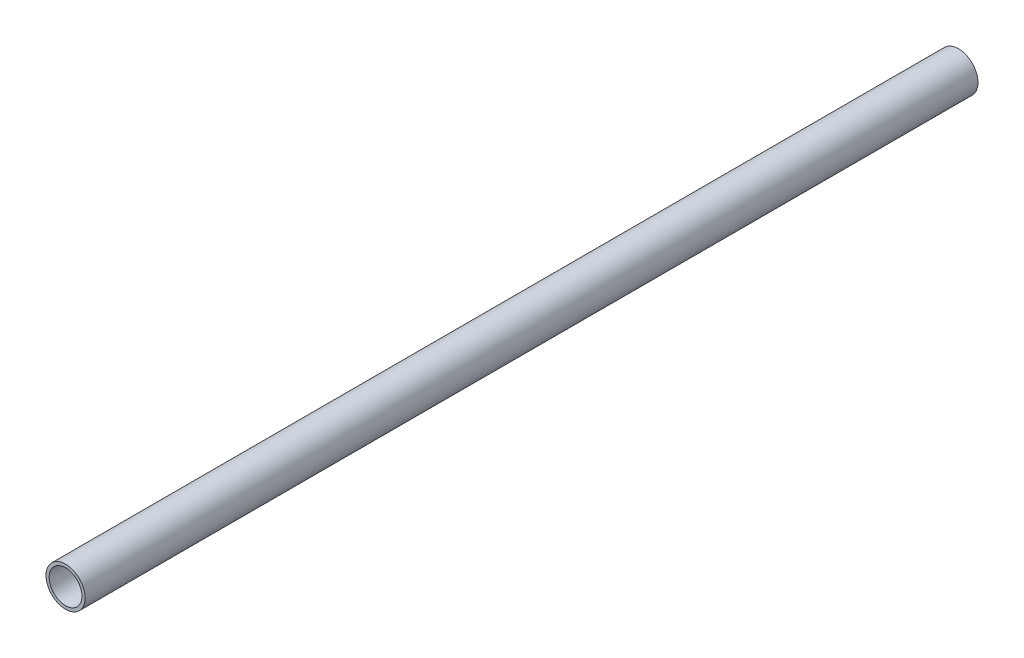
ISO-10303-21;
HEADER;
FILE_DESCRIPTION(('STEP AP214'),'2;1');
FILE_NAME('part.step','',(''),(''),'','','');
FILE_SCHEMA(('AUTOMOTIVE_DESIGN { 1 0 10303 214 1 1 1 1 }'));
ENDSEC;
DATA;
#1=APPLICATION_CONTEXT('core data for automotive mechanical design processes');
#2=APPLICATION_PROTOCOL_DEFINITION('international standard','automotive_design',2000,#1);
#3=PRODUCT_CONTEXT('',#1,'mechanical');
#4=PRODUCT('Part','Part','',(#3));
#5=PRODUCT_RELATED_PRODUCT_CATEGORY('part','',(#4));
#6=PRODUCT_DEFINITION_FORMATION('','',#4);
#7=PRODUCT_DEFINITION_CONTEXT('part definition',#1,'design');
#8=PRODUCT_DEFINITION('design','',#6,#7);
#9=PRODUCT_DEFINITION_SHAPE('','',#8);
#10=(LENGTH_UNIT() NAMED_UNIT(*) SI_UNIT(.MILLI.,.METRE.));
#11=(NAMED_UNIT(*) PLANE_ANGLE_UNIT() SI_UNIT($,.RADIAN.));
#12=(NAMED_UNIT(*) SI_UNIT($,.STERADIAN.) SOLID_ANGLE_UNIT());
#13=UNCERTAINTY_MEASURE_WITH_UNIT(LENGTH_MEASURE(1.E-05),#10,'distance_accuracy_value','');
#14=(GEOMETRIC_REPRESENTATION_CONTEXT(3) GLOBAL_UNCERTAINTY_ASSIGNED_CONTEXT((#13)) GLOBAL_UNIT_ASSIGNED_CONTEXT((#10,
#11,#12)) REPRESENTATION_CONTEXT('',''));
#15=CARTESIAN_POINT('',(0.,0.,0.));
#16=DIRECTION('',(0.,0.,1.));
#17=DIRECTION('',(1.,0.,0.));
#18=AXIS2_PLACEMENT_3D('',#15,#16,#17);
#19=CARTESIAN_POINT('',(0.,0.,-27.));
#20=DIRECTION('',(0.,0.,1.));
#21=DIRECTION('',(1.,0.,0.));
#22=AXIS2_PLACEMENT_3D('',#19,#20,#21);
#23=CYLINDRICAL_SURFACE('',#22,8.35);
#24=CARTESIAN_POINT('',(0.,0.,-27.));
#25=DIRECTION('',(0.,0.,1.));
#26=DIRECTION('',(1.,0.,0.));
#27=AXIS2_PLACEMENT_3D('',#24,#25,#26);
#28=CIRCLE('',#27,8.35);
#29=CARTESIAN_POINT('',(8.35,0.,-27.));
#30=VERTEX_POINT('',#29);
#31=EDGE_CURVE('E10',#30,#30,#28,.T.);
#32=ORIENTED_EDGE('',*,*,#31,.T.);
#33=EDGE_LOOP('',(#32));
#34=FACE_BOUND('',#33,.T.);
#35=CARTESIAN_POINT('',(0.,0.,353.782918688122));
#36=DIRECTION('',(0.000104058239014937,-4.15233031791154E-05,0.999999993723849));
#37=DIRECTION('',(0.928784122908827,-0.370621154928021,-0.000112037055538757));
#38=AXIS2_PLACEMENT_3D('',#35,#36,#37);
#39=ELLIPSE('',#38,8.35000005240586,8.35);
#40=CARTESIAN_POINT('',(7.75534747496243,-3.0946866630717,353.781983178703));
#41=VERTEX_POINT('',#40);
#42=EDGE_CURVE('E42',#41,#41,#39,.T.);
#43=ORIENTED_EDGE('',*,*,#42,.F.);
#44=EDGE_LOOP('',(#43));
#45=FACE_BOUND('',#44,.T.);
#46=ADVANCED_FACE('F32',(#34,#45),#23,.T.);
#47=CARTESIAN_POINT('',(0.,0.,-27.));
#48=DIRECTION('',(0.,0.,1.));
#49=DIRECTION('',(1.,0.,0.));
#50=AXIS2_PLACEMENT_3D('',#47,#48,#49);
#51=PLANE('',#50);
#52=CARTESIAN_POINT('',(0.,0.,-27.));
#53=DIRECTION('',(0.,0.,1.));
#54=DIRECTION('',(1.,0.,0.));
#55=AXIS2_PLACEMENT_3D('',#52,#53,#54);
#56=CIRCLE('',#55,7.);
#57=CARTESIAN_POINT('',(7.,0.,-27.));
#58=VERTEX_POINT('',#57);
#59=EDGE_CURVE('E38',#58,#58,#56,.T.);
#60=ORIENTED_EDGE('',*,*,#59,.T.);
#61=EDGE_LOOP('',(#60));
#62=FACE_BOUND('',#61,.T.);
#63=ORIENTED_EDGE('',*,*,#31,.F.);
#64=EDGE_LOOP('',(#63));
#65=FACE_BOUND('',#64,.T.);
#66=ADVANCED_FACE('F61',(#62,#65),#51,.F.);
#67=CARTESIAN_POINT('',(0.,0.,-27.));
#68=DIRECTION('',(0.,0.,1.));
#69=DIRECTION('',(1.,0.,0.));
#70=AXIS2_PLACEMENT_3D('',#67,#68,#69);
#71=CYLINDRICAL_SURFACE('',#70,7.);
#72=ORIENTED_EDGE('',*,*,#59,.F.);
#73=EDGE_LOOP('',(#72));
#74=FACE_BOUND('',#73,.T.);
#75=CARTESIAN_POINT('',(0.,0.,353.782918688122));
#76=DIRECTION('',(0.000104058239014937,-4.15233031791154E-05,0.999999993723849));
#77=DIRECTION('',(0.928784122908827,-0.370621154928021,-0.000112037055538757));
#78=AXIS2_PLACEMENT_3D('',#75,#76,#77);
#79=ELLIPSE('',#78,7.00000004393306,7.);
#80=CARTESIAN_POINT('',(6.50148890116611,-2.59434810077867,353.782134428729));
#81=VERTEX_POINT('',#80);
#82=EDGE_CURVE('E46',#81,#81,#79,.T.);
#83=ORIENTED_EDGE('',*,*,#82,.T.);
#84=EDGE_LOOP('',(#83));
#85=FACE_BOUND('',#84,.T.);
#86=ADVANCED_FACE('F52',(#74,#85),#71,.F.);
#87=CARTESIAN_POINT('',(7.99767152470557,6.03227226750913,353.782336944374));
#88=DIRECTION('',(0.000104058239014937,-4.15233031791154E-05,0.999999993723849));
#89=DIRECTION('',(-0.933466211572646,0.358665330499031,0.000112027820117461));
#90=AXIS2_PLACEMENT_3D('',#87,#88,#89);
#91=PLANE('',#90);
#92=ORIENTED_EDGE('',*,*,#82,.F.);
#93=EDGE_LOOP('',(#92));
#94=FACE_BOUND('',#93,.T.);
#95=ORIENTED_EDGE('',*,*,#42,.T.);
#96=EDGE_LOOP('',(#95));
#97=FACE_BOUND('',#96,.T.);
#98=ADVANCED_FACE('F54',(#94,#97),#91,.T.);
#99=CLOSED_SHELL('',(#46,#66,#86,#98));
#100=MANIFOLD_SOLID_BREP('B2',#99);
#101=ADVANCED_BREP_SHAPE_REPRESENTATION('',(#18,#100),#14);
#102=SHAPE_DEFINITION_REPRESENTATION(#9,#101);
ENDSEC;
END-ISO-10303-21;
